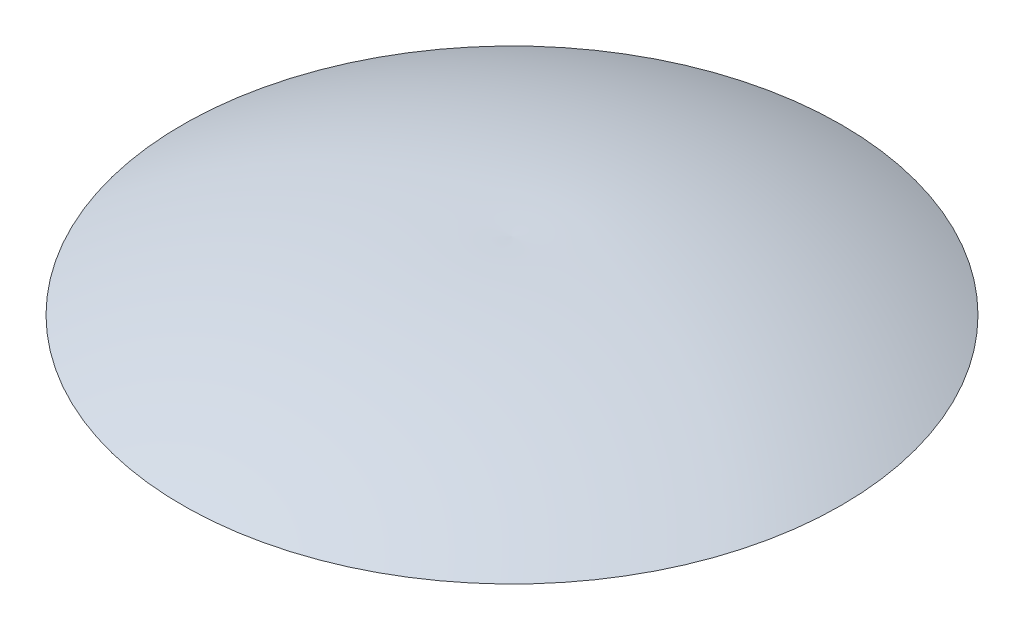
ISO-10303-21;
HEADER;
FILE_DESCRIPTION(('STEP AP214'),'2;1');
FILE_NAME('part.step','',(''),(''),'','','');
FILE_SCHEMA(('AUTOMOTIVE_DESIGN { 1 0 10303 214 1 1 1 1 }'));
ENDSEC;
DATA;
#1=APPLICATION_CONTEXT('core data for automotive mechanical design processes');
#2=APPLICATION_PROTOCOL_DEFINITION('international standard','automotive_design',2000,#1);
#3=PRODUCT_CONTEXT('',#1,'mechanical');
#4=PRODUCT('Part','Part','',(#3));
#5=PRODUCT_RELATED_PRODUCT_CATEGORY('part','',(#4));
#6=PRODUCT_DEFINITION_FORMATION('','',#4);
#7=PRODUCT_DEFINITION_CONTEXT('part definition',#1,'design');
#8=PRODUCT_DEFINITION('design','',#6,#7);
#9=PRODUCT_DEFINITION_SHAPE('','',#8);
#10=(LENGTH_UNIT() NAMED_UNIT(*) SI_UNIT(.MILLI.,.METRE.));
#11=(NAMED_UNIT(*) PLANE_ANGLE_UNIT() SI_UNIT($,.RADIAN.));
#12=(NAMED_UNIT(*) SI_UNIT($,.STERADIAN.) SOLID_ANGLE_UNIT());
#13=UNCERTAINTY_MEASURE_WITH_UNIT(LENGTH_MEASURE(1.E-05),#10,'distance_accuracy_value','');
#14=(GEOMETRIC_REPRESENTATION_CONTEXT(3) GLOBAL_UNCERTAINTY_ASSIGNED_CONTEXT((#13)) GLOBAL_UNIT_ASSIGNED_CONTEXT((#10,
#11,#12)) REPRESENTATION_CONTEXT('',''));
#15=CARTESIAN_POINT('',(0.,0.,0.));
#16=DIRECTION('',(0.,0.,1.));
#17=DIRECTION('',(1.,0.,0.));
#18=AXIS2_PLACEMENT_3D('',#15,#16,#17);
#19=CARTESIAN_POINT('',(0.,0.,0.));
#20=DIRECTION('',(0.,-1.,0.));
#21=DIRECTION('',(0.,0.,-1.));
#22=AXIS2_PLACEMENT_3D('',#19,#20,#21);
#23=PLANE('',#22);
#24=CARTESIAN_POINT('',(0.,0.,0.));
#25=DIRECTION('',(0.,-1.,0.));
#26=DIRECTION('',(0.,0.,-1.));
#27=AXIS2_PLACEMENT_3D('',#24,#25,#26);
#28=CIRCLE('',#27,6.74623999999999);
#29=CARTESIAN_POINT('',(0.,0.,-6.74623999999999));
#30=VERTEX_POINT('',#29);
#31=EDGE_CURVE('E66',#30,#30,#28,.T.);
#32=ORIENTED_EDGE('',*,*,#31,.F.);
#33=EDGE_LOOP('',(#32));
#34=FACE_BOUND('',#33,.T.);
#35=CARTESIAN_POINT('',(0.,0.,0.));
#36=DIRECTION('',(0.,-1.,0.));
#37=DIRECTION('',(0.,0.,-1.));
#38=AXIS2_PLACEMENT_3D('',#35,#36,#37);
#39=CIRCLE('',#38,34.925);
#40=CARTESIAN_POINT('',(0.,0.,-34.925));
#41=VERTEX_POINT('',#40);
#42=EDGE_CURVE('E74',#41,#41,#39,.T.);
#43=ORIENTED_EDGE('',*,*,#42,.T.);
#44=EDGE_LOOP('',(#43));
#45=FACE_BOUND('',#44,.T.);
#46=ADVANCED_FACE('F34',(#34,#45),#23,.T.);
#47=CARTESIAN_POINT('',(92.075,31.75,0.));
#48=CARTESIAN_POINT('',(49.2369184044142,53.1166117974646,0.));
#49=CARTESIAN_POINT('',(0.,50.8,0.));
#50=B_SPLINE_CURVE_WITH_KNOTS('',2,(#47,#48,#49),.UNSPECIFIED.,.F.,.F.,(3,3),(0.,1.),.UNSPECIFIED.);
#51=CARTESIAN_POINT('',(0.,31.75,0.));
#52=DIRECTION('',(0.,-1.,0.));
#53=AXIS1_PLACEMENT('',#51,#52);
#54=SURFACE_OF_REVOLUTION('',#50,#53);
#55=CARTESIAN_POINT('',(0.,50.8,0.));
#56=VERTEX_POINT('',#55);
#57=VERTEX_LOOP('',#56);
#58=FACE_BOUND('',#57,.T.);
#59=CARTESIAN_POINT('',(0.,31.75,0.));
#60=DIRECTION('',(0.,-1.,0.));
#61=DIRECTION('',(0.,0.,-1.));
#62=AXIS2_PLACEMENT_3D('',#59,#60,#61);
#63=CIRCLE('',#62,92.075);
#64=CARTESIAN_POINT('',(0.,31.75,-92.075));
#65=VERTEX_POINT('',#64);
#66=EDGE_CURVE('E46',#65,#65,#63,.T.);
#67=ORIENTED_EDGE('',*,*,#66,.F.);
#68=EDGE_LOOP('',(#67));
#69=FACE_BOUND('',#68,.T.);
#70=ADVANCED_FACE('F90',(#58,#69),#54,.F.);
#71=CARTESIAN_POINT('',(44.45,12.7,0.));
#72=CARTESIAN_POINT('',(69.7506104319969,18.1599350568815,0.));
#73=CARTESIAN_POINT('',(92.075,31.75,0.));
#74=B_SPLINE_CURVE_WITH_KNOTS('',2,(#71,#72,#73),.UNSPECIFIED.,.F.,.F.,(3,3),(0.,1.),.UNSPECIFIED.);
#75=CARTESIAN_POINT('',(0.,31.75,0.));
#76=DIRECTION('',(0.,-1.,0.));
#77=AXIS1_PLACEMENT('',#75,#76);
#78=SURFACE_OF_REVOLUTION('',#74,#77);
#79=ORIENTED_EDGE('',*,*,#66,.T.);
#80=EDGE_LOOP('',(#79));
#81=FACE_BOUND('',#80,.T.);
#82=CARTESIAN_POINT('',(0.,12.7,0.));
#83=DIRECTION('',(0.,-1.,0.));
#84=DIRECTION('',(0.,0.,-1.));
#85=AXIS2_PLACEMENT_3D('',#82,#83,#84);
#86=CIRCLE('',#85,44.45);
#87=CARTESIAN_POINT('',(0.,12.7,-44.45));
#88=VERTEX_POINT('',#87);
#89=EDGE_CURVE('E102',#88,#88,#86,.T.);
#90=ORIENTED_EDGE('',*,*,#89,.F.);
#91=EDGE_LOOP('',(#90));
#92=FACE_BOUND('',#91,.T.);
#93=ADVANCED_FACE('F87',(#81,#92),#78,.F.);
#94=CARTESIAN_POINT('',(0.,0.,0.));
#95=DIRECTION('',(0.,1.,0.));
#96=DIRECTION('',(0.,0.,1.));
#97=AXIS2_PLACEMENT_3D('',#94,#95,#96);
#98=CONICAL_SURFACE('',#97,34.925,0.643501108793284);
#99=CARTESIAN_POINT('',(-39.1097914830597,5.58076275695732,-0.247098392862596));
#100=CARTESIAN_POINT('',(-39.0302156188654,5.4745263693408,-0.230883964768263));
#101=CARTESIAN_POINT('',(-38.95144681485,5.36927905233993,-0.203439402888023));
#102=CARTESIAN_POINT('',(-38.7977249521417,5.16388529927337,-0.126836508878099));
#103=CARTESIAN_POINT('',(-38.722776533864,5.06374506643408,-0.0776524404008542));
#104=CARTESIAN_POINT('',(-38.5787658882346,4.87165641929498,0.0409937978895639));
#105=CARTESIAN_POINT('',(-38.5097006587945,4.77970382588734,0.110445544406168));
#106=CARTESIAN_POINT('',(-38.3791891190264,4.60672194289519,0.267634899931323));
#107=CARTESIAN_POINT('',(-38.3177409938501,4.52569005094574,0.355368139791067));
#108=CARTESIAN_POINT('',(-38.2039006735314,4.37692147382021,0.546715964909872));
#109=CARTESIAN_POINT('',(-38.1515160203464,4.3091958548578,0.650343642385449));
#110=CARTESIAN_POINT('',(-38.0571193929553,4.18921591602772,0.870485317638518));
#111=CARTESIAN_POINT('',(-38.0151078024814,4.13696216849913,0.986999791908466));
#112=CARTESIAN_POINT('',(-37.9424569881173,4.04957122665621,1.22958770746755));
#113=CARTESIAN_POINT('',(-37.9118166955665,4.01443242380343,1.35566024915955));
#114=CARTESIAN_POINT('',(-37.8626308645981,3.96237885710568,1.61378463240449));
#115=CARTESIAN_POINT('',(-37.844085209582,3.94546391757235,1.74583641630139));
#116=CARTESIAN_POINT('',(-37.819558069238,3.93040642297335,2.01200883029451));
#117=CARTESIAN_POINT('',(-37.8135625729266,3.93224292034107,2.14612698474037));
#118=CARTESIAN_POINT('',(-37.8142721104321,3.95457908452192,2.41276541562187));
#119=CARTESIAN_POINT('',(-37.8209770939314,3.97507867739443,2.54528569838597));
#120=CARTESIAN_POINT('',(-37.8469785733538,4.03407727555278,2.80492465522841));
#121=CARTESIAN_POINT('',(-37.8662705401024,4.07256980502766,2.93204525475707));
#122=CARTESIAN_POINT('',(-37.9170495624634,4.16633745165633,3.17734694067508));
#123=CARTESIAN_POINT('',(-37.9485367148318,4.22161270196273,3.29552795612928));
#124=CARTESIAN_POINT('',(-38.0230573492084,4.34728505425784,3.51973342979011));
#125=CARTESIAN_POINT('',(-38.0661021770979,4.41769700195005,3.62574579556967));
#126=CARTESIAN_POINT('',(-38.1627372586128,4.57144285095898,3.82249384480039));
#127=CARTESIAN_POINT('',(-38.2163275576628,4.65477680793702,3.91322946244373));
#128=CARTESIAN_POINT('',(-38.3328088436555,4.83190420931864,4.07692685554425));
#129=CARTESIAN_POINT('',(-38.3957066062672,4.92570526124549,4.14987557915252));
#130=CARTESIAN_POINT('',(-38.5291881925226,5.12091003154347,4.27584823949298));
#131=CARTESIAN_POINT('',(-38.5997719807499,5.2223137148819,4.32887226803084));
#132=CARTESIAN_POINT('',(-38.7467159395336,5.42966640479138,4.4134618704213));
#133=CARTESIAN_POINT('',(-38.8230722216632,5.53561233118748,4.44504174869385));
#134=CARTESIAN_POINT('',(-38.9795073051832,5.74904449822497,4.48590140769758));
#135=CARTESIAN_POINT('',(-39.0595860831568,5.85653072917401,4.4951813286891));
#136=CARTESIAN_POINT('',(-39.2211111805142,6.06988389026064,4.49117893936555));
#137=CARTESIAN_POINT('',(-39.302556126616,6.17575226344687,4.47791808218736));
#138=CARTESIAN_POINT('',(-39.4645044057405,6.38302487885103,4.42925161779637));
#139=CARTESIAN_POINT('',(-39.5450077369917,6.48442911267171,4.39384596893008));
#140=CARTESIAN_POINT('',(-39.7026777432474,6.68002730133749,4.30188029027803));
#141=CARTESIAN_POINT('',(-39.7798435517283,6.77421938851943,4.24531480309413));
#142=CARTESIAN_POINT('',(-39.9284534619476,6.95283642651115,4.11262721192361));
#143=CARTESIAN_POINT('',(-39.9998975255201,7.03726131217218,4.03650497750137));
#144=CARTESIAN_POINT('',(-40.1349086577147,7.19419376474691,3.86675985612908));
#145=CARTESIAN_POINT('',(-40.1984675494269,7.26668898562433,3.77311905061332));
#146=CARTESIAN_POINT('',(-40.3156124236,7.39776016236401,3.57102823107899));
#147=CARTESIAN_POINT('',(-40.369198386304,7.45633609065162,3.46257818772341));
#148=CARTESIAN_POINT('',(-40.4646967693817,7.55806049754061,3.23390264112232));
#149=CARTESIAN_POINT('',(-40.5066064558169,7.60120536371033,3.11367438896358));
#150=CARTESIAN_POINT('',(-40.5773888787468,7.6709327848046,2.86486762715966));
#151=CARTESIAN_POINT('',(-40.6062617045733,7.69751545321805,2.73628917473909));
#152=CARTESIAN_POINT('',(-40.6500281120404,7.73341738954163,2.47454603528559));
#153=CARTESIAN_POINT('',(-40.6649338248022,7.74275164540559,2.34138543250127));
#154=CARTESIAN_POINT('',(-40.6803486810637,7.74396213124021,2.07415482479247));
#155=CARTESIAN_POINT('',(-40.6808578620848,7.7358384067114,1.94008482223906));
#156=CARTESIAN_POINT('',(-40.6675019326367,7.70235308626437,1.67493391314521));
#157=CARTESIAN_POINT('',(-40.6536461137522,7.6770026366071,1.54385113042192));
#158=CARTESIAN_POINT('',(-40.6120652230495,7.60972737193164,1.28830562633715));
#159=CARTESIAN_POINT('',(-40.5843400759185,7.56780246691158,1.16384294092799));
#160=CARTESIAN_POINT('',(-40.5159387762225,7.4684306699892,0.925001166118774));
#161=CARTESIAN_POINT('',(-40.4752553825209,7.41097510219403,0.810627760402362));
#162=CARTESIAN_POINT('',(-40.3822860551547,7.28204262700732,0.595291285737196));
#163=CARTESIAN_POINT('',(-40.3300004905415,7.21056616561235,0.494327790398181));
#164=CARTESIAN_POINT('',(-40.2154671679103,7.05539324926631,0.308595807092394));
#165=CARTESIAN_POINT('',(-40.153211290263,6.97168683939753,0.223840643376585));
#166=CARTESIAN_POINT('',(-40.0207191954711,6.79428662172312,0.0730248472669457));
#167=CARTESIAN_POINT('',(-39.9504810459595,6.70059039590036,0.00696875515635962));
#168=CARTESIAN_POINT('',(-39.8041946246849,6.50572343083859,-0.104552708917283));
#169=CARTESIAN_POINT('',(-39.7281442113619,6.40454993701711,-0.150010448143742));
#170=CARTESIAN_POINT('',(-39.5726116311289,6.19760228105639,-0.218950067713439));
#171=CARTESIAN_POINT('',(-39.4931336482752,6.09183372703342,-0.242457990008649));
#172=CARTESIAN_POINT('',(-39.3626380708978,5.91801633503232,-0.262409243666245));
#173=CARTESIAN_POINT('',(-39.3119322159998,5.85043954773353,-0.265635911579234));
#174=CARTESIAN_POINT('',(-39.2106407364236,5.71536455474689,-0.263101354908478));
#175=CARTESIAN_POINT('',(-39.1600551115973,5.64786634896232,-0.25734014139949));
#176=CARTESIAN_POINT('',(-39.1097914830597,5.58076275695732,-0.247098392862596));
#177=B_SPLINE_CURVE_WITH_KNOTS('',3,(#99,#100,#101,#102,#103,#104,#105,#106,#107,#108,#109,#110,
#111,#112,#113,#114,#115,#116,#117,#118,#119,#120,#121,#122,#123,#124,#125,#126,#127,#128,#129,
#130,#131,#132,#133,#134,#135,#136,#137,#138,#139,#140,#141,#142,#143,#144,#145,#146,#147,#148,
#149,#150,#151,#152,#153,#154,#155,#156,#157,#158,#159,#160,#161,#162,#163,#164,#165,#166,#167,
#168,#169,#170,#171,#172,#173,#174,#175,#176),.UNSPECIFIED.,.T.,.F.,(4,2,2,2,2,2,2,2,2,2,2,2,2,
2,2,2,2,2,2,2,2,2,2,2,2,2,2,2,2,2,2,2,2,2,2,2,2,2,4),(0.,0.400855563732254,0.802186957291368,
1.20331231608986,1.60434191846492,2.00570363989225,2.40708020673158,2.80841904313769,
3.20975401037588,3.61064068821779,4.01152577780863,4.41226669640532,4.8130107945277,
5.21414974060841,5.61529041463592,6.01672456185357,6.41815685938747,6.81932111590076,
7.22048284919923,7.62126299142902,8.02204388751272,8.42292822156171,8.823815229417,
9.22511454187724,9.62641464932051,10.0278086402437,10.4291998806703,10.8302421691279,
11.2312834123551,11.6320654153956,12.0328495947749,12.4338581285499,12.8348539085417,
13.2361779280339,13.6375993087695,14.0391693151327,14.4402622785826,14.6934606595663,
14.9466587285624),.UNSPECIFIED.);
#178=CARTESIAN_POINT('',(-39.1097914830597,5.58076275695732,-0.247098392862596));
#179=VERTEX_POINT('',#178);
#180=EDGE_CURVE('E11',#179,#179,#177,.T.);
#181=ORIENTED_EDGE('',*,*,#180,.F.);
#182=EDGE_LOOP('',(#181));
#183=FACE_BOUND('',#182,.T.);
#184=ORIENTED_EDGE('',*,*,#89,.T.);
#185=EDGE_LOOP('',(#184));
#186=FACE_BOUND('',#185,.T.);
#187=ORIENTED_EDGE('',*,*,#42,.F.);
#188=EDGE_LOOP('',(#187));
#189=FACE_BOUND('',#188,.T.);
#190=ADVANCED_FACE('F89',(#183,#186,#189),#98,.T.);
#191=CARTESIAN_POINT('',(0.,19.05,0.));
#192=DIRECTION('',(0.,-1.,0.));
#193=DIRECTION('',(0.,0.,-1.));
#194=AXIS2_PLACEMENT_3D('',#191,#192,#193);
#195=CONICAL_SURFACE('',#194,6.74623999999999,1.02974425867665);
#196=CARTESIAN_POINT('',(0.,23.1035499425085,0.));
#197=VERTEX_POINT('',#196);
#198=VERTEX_LOOP('',#197);
#199=FACE_BOUND('',#198,.T.);
#200=CARTESIAN_POINT('',(0.,19.05,0.));
#201=DIRECTION('',(0.,-1.,0.));
#202=DIRECTION('',(0.,0.,-1.));
#203=AXIS2_PLACEMENT_3D('',#200,#201,#202);
#204=CIRCLE('',#203,6.74623999999999);
#205=CARTESIAN_POINT('',(0.,19.05,-6.74623999999999));
#206=VERTEX_POINT('',#205);
#207=EDGE_CURVE('E69',#206,#206,#204,.T.);
#208=ORIENTED_EDGE('',*,*,#207,.T.);
#209=EDGE_LOOP('',(#208));
#210=FACE_BOUND('',#209,.T.);
#211=ADVANCED_FACE('F110',(#199,#210),#195,.F.);
#212=CARTESIAN_POINT('',(0.,0.,0.));
#213=DIRECTION('',(0.,-1.,0.));
#214=DIRECTION('',(0.,0.,-1.));
#215=AXIS2_PLACEMENT_3D('',#212,#213,#214);
#216=CYLINDRICAL_SURFACE('',#215,6.74623999999999);
#217=ORIENTED_EDGE('',*,*,#207,.F.);
#218=EDGE_LOOP('',(#217));
#219=FACE_BOUND('',#218,.T.);
#220=ORIENTED_EDGE('',*,*,#31,.T.);
#221=EDGE_LOOP('',(#220));
#222=FACE_BOUND('',#221,.T.);
#223=ADVANCED_FACE('F60',(#219,#222),#216,.F.);
#224=CARTESIAN_POINT('',(-29.1014895298559,13.4583884328563,1.56967509949602));
#225=DIRECTION('',(-0.798838811482965,-0.6,0.0430877391897539));
#226=DIRECTION('',(0.600557742710097,-0.799581389022377,0.));
#227=AXIS2_PLACEMENT_3D('',#224,#225,#226);
#228=CONICAL_SURFACE('',#227,2.38125,1.02974425867665);
#229=CARTESIAN_POINT('',(-27.9585114783827,14.3168680422919,1.50802519031088));
#230=VERTEX_POINT('',#229);
#231=VERTEX_LOOP('',#230);
#232=FACE_BOUND('',#231,.T.);
#233=CARTESIAN_POINT('',(-29.1014895298559,13.4583884328563,1.56967509949602));
#234=DIRECTION('',(-0.798838811482965,-0.6,0.0430877391897539));
#235=DIRECTION('',(0.600557742710097,-0.799581389022377,0.));
#236=AXIS2_PLACEMENT_3D('',#233,#234,#235);
#237=CIRCLE('',#236,2.38125);
#238=CARTESIAN_POINT('',(-27.6714114050275,11.5543852502468,1.56967509949602));
#239=VERTEX_POINT('',#238);
#240=EDGE_CURVE('E64',#239,#239,#237,.T.);
#241=ORIENTED_EDGE('',*,*,#240,.T.);
#242=EDGE_LOOP('',(#241));
#243=FACE_BOUND('',#242,.T.);
#244=ADVANCED_FACE('F56',(#232,#243),#228,.F.);
#245=CARTESIAN_POINT('',(-39.2467424356896,5.8383884328563,2.1168893872059));
#246=DIRECTION('',(-0.798838811482965,-0.6,0.0430877391897539));
#247=DIRECTION('',(0.600557742710097,-0.799581389022377,0.));
#248=AXIS2_PLACEMENT_3D('',#245,#246,#247);
#249=CYLINDRICAL_SURFACE('',#248,2.38125);
#250=ORIENTED_EDGE('',*,*,#180,.T.);
#251=EDGE_LOOP('',(#250));
#252=FACE_BOUND('',#251,.T.);
#253=ORIENTED_EDGE('',*,*,#240,.F.);
#254=EDGE_LOOP('',(#253));
#255=FACE_BOUND('',#254,.T.);
#256=ADVANCED_FACE('F59',(#252,#255),#249,.F.);
#257=CLOSED_SHELL('',(#46,#70,#93,#190,#211,#223,#244,#256));
#258=MANIFOLD_SOLID_BREP('B2',#257);
#259=ADVANCED_BREP_SHAPE_REPRESENTATION('',(#18,#258),#14);
#260=SHAPE_DEFINITION_REPRESENTATION(#9,#259);
ENDSEC;
END-ISO-10303-21;
